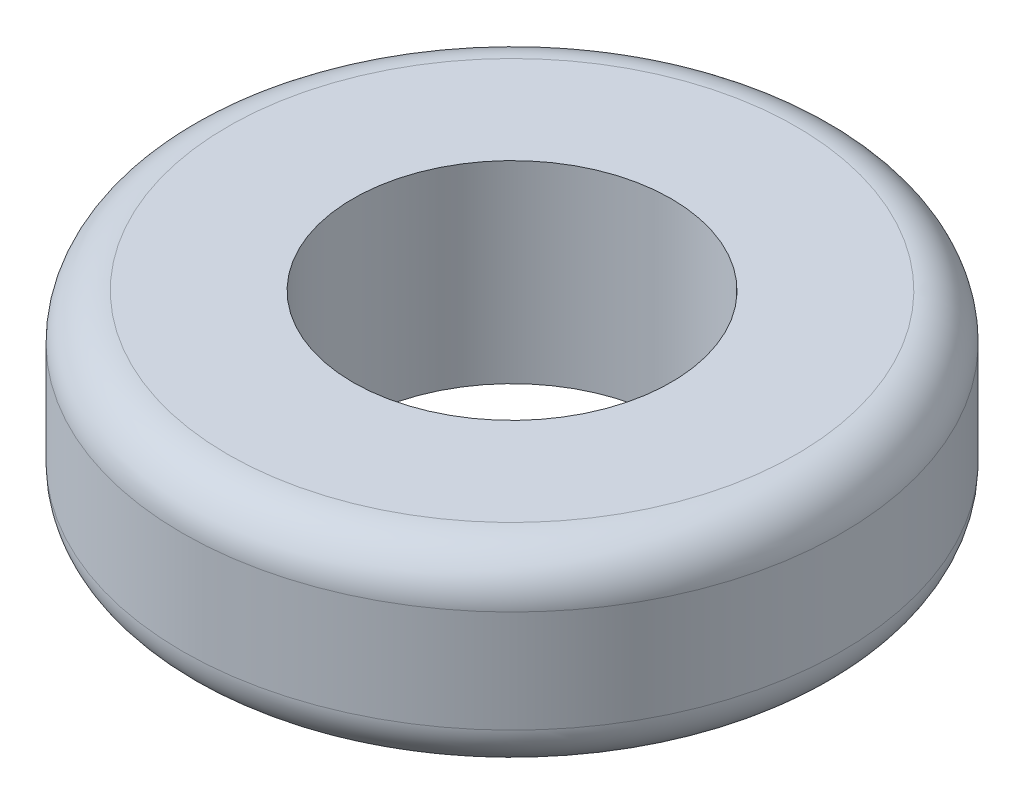
ISO-10303-21;
HEADER;
FILE_DESCRIPTION(('STEP AP214'),'2;1');
FILE_NAME('part.step','',(''),(''),'','','');
FILE_SCHEMA(('AUTOMOTIVE_DESIGN { 1 0 10303 214 1 1 1 1 }'));
ENDSEC;
DATA;
#1=APPLICATION_CONTEXT('core data for automotive mechanical design processes');
#2=APPLICATION_PROTOCOL_DEFINITION('international standard','automotive_design',2000,#1);
#3=PRODUCT_CONTEXT('',#1,'mechanical');
#4=PRODUCT('Part','Part','',(#3));
#5=PRODUCT_RELATED_PRODUCT_CATEGORY('part','',(#4));
#6=PRODUCT_DEFINITION_FORMATION('','',#4);
#7=PRODUCT_DEFINITION_CONTEXT('part definition',#1,'design');
#8=PRODUCT_DEFINITION('design','',#6,#7);
#9=PRODUCT_DEFINITION_SHAPE('','',#8);
#10=(LENGTH_UNIT() NAMED_UNIT(*) SI_UNIT(.MILLI.,.METRE.));
#11=(NAMED_UNIT(*) PLANE_ANGLE_UNIT() SI_UNIT($,.RADIAN.));
#12=(NAMED_UNIT(*) SI_UNIT($,.STERADIAN.) SOLID_ANGLE_UNIT());
#13=UNCERTAINTY_MEASURE_WITH_UNIT(LENGTH_MEASURE(1.E-05),#10,'distance_accuracy_value','');
#14=(GEOMETRIC_REPRESENTATION_CONTEXT(3) GLOBAL_UNCERTAINTY_ASSIGNED_CONTEXT((#13)) GLOBAL_UNIT_ASSIGNED_CONTEXT((#10,
#11,#12)) REPRESENTATION_CONTEXT('',''));
#15=CARTESIAN_POINT('',(0.,0.,0.));
#16=DIRECTION('',(0.,0.,1.));
#17=DIRECTION('',(1.,0.,0.));
#18=AXIS2_PLACEMENT_3D('',#15,#16,#17);
#19=CARTESIAN_POINT('',(0.,4.25,0.));
#20=DIRECTION('',(0.,1.,0.));
#21=DIRECTION('',(0.,0.,1.));
#22=AXIS2_PLACEMENT_3D('',#19,#20,#21);
#23=PLANE('',#22);
#24=CARTESIAN_POINT('',(0.,4.25,0.));
#25=DIRECTION('',(0.,1.,0.));
#26=DIRECTION('',(0.,0.,1.));
#27=AXIS2_PLACEMENT_3D('',#24,#25,#26);
#28=CIRCLE('',#27,6.25);
#29=CARTESIAN_POINT('',(0.,4.25,6.25));
#30=VERTEX_POINT('',#29);
#31=EDGE_CURVE('E46',#30,#30,#28,.T.);
#32=ORIENTED_EDGE('',*,*,#31,.T.);
#33=EDGE_LOOP('',(#32));
#34=FACE_BOUND('',#33,.T.);
#35=CARTESIAN_POINT('',(0.,4.25,0.));
#36=DIRECTION('',(0.,1.,0.));
#37=DIRECTION('',(0.,0.,1.));
#38=AXIS2_PLACEMENT_3D('',#35,#36,#37);
#39=CIRCLE('',#38,3.5);
#40=CARTESIAN_POINT('',(0.,4.25,3.5));
#41=VERTEX_POINT('',#40);
#42=EDGE_CURVE('E51',#41,#41,#39,.T.);
#43=ORIENTED_EDGE('',*,*,#42,.F.);
#44=EDGE_LOOP('',(#43));
#45=FACE_BOUND('',#44,.T.);
#46=ADVANCED_FACE('F31',(#34,#45),#23,.T.);
#47=CARTESIAN_POINT('',(0.,0.,0.));
#48=DIRECTION('',(0.,1.,0.));
#49=DIRECTION('',(0.,0.,1.));
#50=AXIS2_PLACEMENT_3D('',#47,#48,#49);
#51=PLANE('',#50);
#52=CARTESIAN_POINT('',(0.,0.,0.));
#53=DIRECTION('',(0.,1.,0.));
#54=DIRECTION('',(0.,0.,1.));
#55=AXIS2_PLACEMENT_3D('',#52,#53,#54);
#56=CIRCLE('',#55,6.25);
#57=CARTESIAN_POINT('',(0.,0.,6.25));
#58=VERTEX_POINT('',#57);
#59=EDGE_CURVE('E10',#58,#58,#56,.F.);
#60=ORIENTED_EDGE('',*,*,#59,.T.);
#61=EDGE_LOOP('',(#60));
#62=FACE_BOUND('',#61,.T.);
#63=CARTESIAN_POINT('',(0.,0.,0.));
#64=DIRECTION('',(0.,1.,0.));
#65=DIRECTION('',(0.,0.,1.));
#66=AXIS2_PLACEMENT_3D('',#63,#64,#65);
#67=CIRCLE('',#66,3.5);
#68=CARTESIAN_POINT('',(0.,0.,3.5));
#69=VERTEX_POINT('',#68);
#70=EDGE_CURVE('E52',#69,#69,#67,.T.);
#71=ORIENTED_EDGE('',*,*,#70,.T.);
#72=EDGE_LOOP('',(#71));
#73=FACE_BOUND('',#72,.T.);
#74=ADVANCED_FACE('F62',(#62,#73),#51,.F.);
#75=CARTESIAN_POINT('',(0.,4.25,0.));
#76=DIRECTION('',(0.,-1.,0.));
#77=DIRECTION('',(0.,0.,-1.));
#78=AXIS2_PLACEMENT_3D('',#75,#76,#77);
#79=CYLINDRICAL_SURFACE('',#78,7.25);
#80=CARTESIAN_POINT('',(0.,3.25,0.));
#81=DIRECTION('',(0.,1.,0.));
#82=DIRECTION('',(0.,0.,1.));
#83=AXIS2_PLACEMENT_3D('',#80,#81,#82);
#84=CIRCLE('',#83,7.25);
#85=CARTESIAN_POINT('',(0.,3.25,7.25));
#86=VERTEX_POINT('',#85);
#87=EDGE_CURVE('E38',#86,#86,#84,.F.);
#88=ORIENTED_EDGE('',*,*,#87,.T.);
#89=EDGE_LOOP('',(#88));
#90=FACE_BOUND('',#89,.T.);
#91=CARTESIAN_POINT('',(0.,1.,0.));
#92=DIRECTION('',(0.,1.,0.));
#93=DIRECTION('',(0.,0.,1.));
#94=AXIS2_PLACEMENT_3D('',#91,#92,#93);
#95=CIRCLE('',#94,7.25);
#96=CARTESIAN_POINT('',(0.,1.,7.25));
#97=VERTEX_POINT('',#96);
#98=EDGE_CURVE('E42',#97,#97,#95,.T.);
#99=ORIENTED_EDGE('',*,*,#98,.T.);
#100=EDGE_LOOP('',(#99));
#101=FACE_BOUND('',#100,.T.);
#102=ADVANCED_FACE('F68',(#90,#101),#79,.T.);
#103=CARTESIAN_POINT('',(0.,4.25,0.));
#104=DIRECTION('',(0.,-1.,0.));
#105=DIRECTION('',(0.,0.,-1.));
#106=AXIS2_PLACEMENT_3D('',#103,#104,#105);
#107=CYLINDRICAL_SURFACE('',#106,3.5);
#108=ORIENTED_EDGE('',*,*,#42,.T.);
#109=EDGE_LOOP('',(#108));
#110=FACE_BOUND('',#109,.T.);
#111=ORIENTED_EDGE('',*,*,#70,.F.);
#112=EDGE_LOOP('',(#111));
#113=FACE_BOUND('',#112,.T.);
#114=ADVANCED_FACE('F58',(#110,#113),#107,.F.);
#115=CARTESIAN_POINT('',(0.,3.25,0.));
#116=DIRECTION('',(0.,1.,0.));
#117=DIRECTION('',(0.,0.,1.));
#118=AXIS2_PLACEMENT_3D('',#115,#116,#117);
#119=TOROIDAL_SURFACE('',#118,6.25,1.);
#120=ORIENTED_EDGE('',*,*,#87,.F.);
#121=EDGE_LOOP('',(#120));
#122=FACE_BOUND('',#121,.T.);
#123=ORIENTED_EDGE('',*,*,#31,.F.);
#124=EDGE_LOOP('',(#123));
#125=FACE_BOUND('',#124,.T.);
#126=ADVANCED_FACE('F73',(#122,#125),#119,.T.);
#127=CARTESIAN_POINT('',(0.,1.,0.));
#128=DIRECTION('',(0.,1.,0.));
#129=DIRECTION('',(0.,0.,1.));
#130=AXIS2_PLACEMENT_3D('',#127,#128,#129);
#131=TOROIDAL_SURFACE('',#130,6.25,1.);
#132=ORIENTED_EDGE('',*,*,#59,.F.);
#133=EDGE_LOOP('',(#132));
#134=FACE_BOUND('',#133,.T.);
#135=ORIENTED_EDGE('',*,*,#98,.F.);
#136=EDGE_LOOP('',(#135));
#137=FACE_BOUND('',#136,.T.);
#138=ADVANCED_FACE('F33',(#134,#137),#131,.T.);
#139=CLOSED_SHELL('',(#46,#74,#102,#114,#126,#138));
#140=MANIFOLD_SOLID_BREP('B2',#139);
#141=ADVANCED_BREP_SHAPE_REPRESENTATION('',(#18,#140),#14);
#142=SHAPE_DEFINITION_REPRESENTATION(#9,#141);
ENDSEC;
END-ISO-10303-21;
